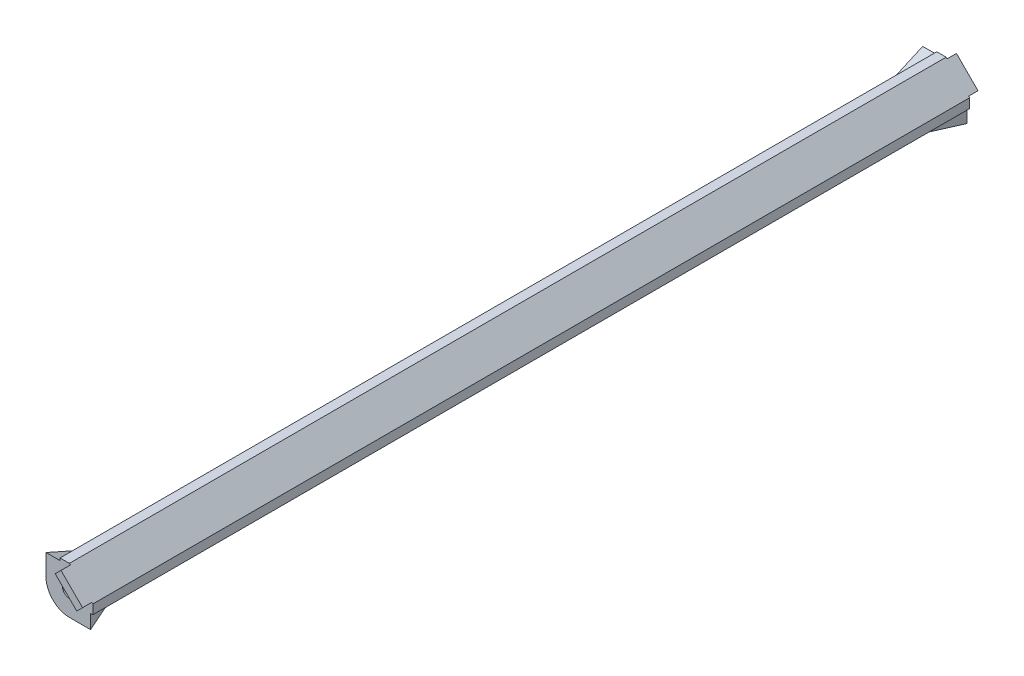
ISO-10303-21;
HEADER;
FILE_DESCRIPTION(('STEP AP214'),'2;1');
FILE_NAME('part.step','',(''),(''),'','','');
FILE_SCHEMA(('AUTOMOTIVE_DESIGN { 1 0 10303 214 1 1 1 1 }'));
ENDSEC;
DATA;
#1=APPLICATION_CONTEXT('core data for automotive mechanical design processes');
#2=APPLICATION_PROTOCOL_DEFINITION('international standard','automotive_design',2000,#1);
#3=PRODUCT_CONTEXT('',#1,'mechanical');
#4=PRODUCT('Part','Part','',(#3));
#5=PRODUCT_RELATED_PRODUCT_CATEGORY('part','',(#4));
#6=PRODUCT_DEFINITION_FORMATION('','',#4);
#7=PRODUCT_DEFINITION_CONTEXT('part definition',#1,'design');
#8=PRODUCT_DEFINITION('design','',#6,#7);
#9=PRODUCT_DEFINITION_SHAPE('','',#8);
#10=(LENGTH_UNIT() NAMED_UNIT(*) SI_UNIT(.MILLI.,.METRE.));
#11=(NAMED_UNIT(*) PLANE_ANGLE_UNIT() SI_UNIT($,.RADIAN.));
#12=(NAMED_UNIT(*) SI_UNIT($,.STERADIAN.) SOLID_ANGLE_UNIT());
#13=UNCERTAINTY_MEASURE_WITH_UNIT(LENGTH_MEASURE(1.E-05),#10,'distance_accuracy_value','');
#14=(GEOMETRIC_REPRESENTATION_CONTEXT(3) GLOBAL_UNCERTAINTY_ASSIGNED_CONTEXT((#13)) GLOBAL_UNIT_ASSIGNED_CONTEXT((#10,
#11,#12)) REPRESENTATION_CONTEXT('',''));
#15=CARTESIAN_POINT('',(0.,0.,0.));
#16=DIRECTION('',(0.,0.,1.));
#17=DIRECTION('',(1.,0.,0.));
#18=AXIS2_PLACEMENT_3D('',#15,#16,#17);
#19=CARTESIAN_POINT('',(10.,-5.,187.));
#20=DIRECTION('',(0.,1.,0.));
#21=DIRECTION('',(-1.,0.,0.));
#22=AXIS2_PLACEMENT_3D('',#19,#20,#21);
#23=PLANE('',#22);
#24=DIRECTION('',(-0.406138466053449,0.,0.913811548620256));
#25=VECTOR('',#24,1.);
#26=CARTESIAN_POINT('',(9.5,-5.,0.));
#27=LINE('',#26,#25);
#28=CARTESIAN_POINT('',(9.5,-5.,0.));
#29=VERTEX_POINT('',#28);
#30=CARTESIAN_POINT('',(5.49999999999998,-5.,9.));
#31=VERTEX_POINT('',#30);
#32=EDGE_CURVE('E250',#29,#31,#27,.T.);
#33=ORIENTED_EDGE('',*,*,#32,.T.);
#34=DIRECTION('',(0.,0.,1.));
#35=VECTOR('',#34,1.);
#36=CARTESIAN_POINT('',(5.5,-5.,178.));
#37=LINE('',#36,#35);
#38=CARTESIAN_POINT('',(5.5,-5.,178.));
#39=VERTEX_POINT('',#38);
#40=EDGE_CURVE('E265',#31,#39,#37,.T.);
#41=ORIENTED_EDGE('',*,*,#40,.T.);
#42=DIRECTION('',(0.406138466053447,0.,0.913811548620257));
#43=VECTOR('',#42,1.);
#44=CARTESIAN_POINT('',(5.5,-5.,178.));
#45=LINE('',#44,#43);
#46=CARTESIAN_POINT('',(9.5,-5.,187.));
#47=VERTEX_POINT('',#46);
#48=EDGE_CURVE('E245',#39,#47,#45,.T.);
#49=ORIENTED_EDGE('',*,*,#48,.T.);
#50=DIRECTION('',(1.,0.,0.));
#51=VECTOR('',#50,1.);
#52=CARTESIAN_POINT('',(10.,-5.,187.));
#53=LINE('',#52,#51);
#54=CARTESIAN_POINT('',(5.,-5.,187.));
#55=VERTEX_POINT('',#54);
#56=EDGE_CURVE('E321',#55,#47,#53,.T.);
#57=ORIENTED_EDGE('',*,*,#56,.F.);
#58=DIRECTION('',(0.,0.,-1.));
#59=VECTOR('',#58,1.);
#60=CARTESIAN_POINT('',(5.,-5.,187.));
#61=LINE('',#60,#59);
#62=CARTESIAN_POINT('',(5.,-5.,0.));
#63=VERTEX_POINT('',#62);
#64=EDGE_CURVE('E46',#55,#63,#61,.T.);
#65=ORIENTED_EDGE('',*,*,#64,.T.);
#66=DIRECTION('',(1.,0.,0.));
#67=VECTOR('',#66,1.);
#68=CARTESIAN_POINT('',(10.,-5.,0.));
#69=LINE('',#68,#67);
#70=EDGE_CURVE('E339',#63,#29,#69,.T.);
#71=ORIENTED_EDGE('',*,*,#70,.T.);
#72=EDGE_LOOP('',(#33,#41,#49,#57,#65,#71));
#73=FACE_BOUND('',#72,.T.);
#74=ADVANCED_FACE('F38',(#73),#23,.F.);
#75=CARTESIAN_POINT('',(5.,0.,187.));
#76=DIRECTION('',(0.,0.,-1.));
#77=DIRECTION('',(-1.,0.,0.));
#78=AXIS2_PLACEMENT_3D('',#75,#76,#77);
#79=PLANE('',#78);
#80=CARTESIAN_POINT('',(5.,0.,187.));
#81=DIRECTION('',(0.,0.,1.));
#82=DIRECTION('',(1.,0.,0.));
#83=AXIS2_PLACEMENT_3D('',#80,#81,#82);
#84=CIRCLE('',#83,1.5);
#85=CARTESIAN_POINT('',(6.5,0.,187.));
#86=VERTEX_POINT('',#85);
#87=EDGE_CURVE('E306',#86,#86,#84,.T.);
#88=ORIENTED_EDGE('',*,*,#87,.F.);
#89=EDGE_LOOP('',(#88));
#90=FACE_BOUND('',#89,.T.);
#91=DIRECTION('',(-0.707106781186548,0.707106781186547,0.));
#92=VECTOR('',#91,1.);
#93=CARTESIAN_POINT('',(5.,5.,187.));
#94=LINE('',#93,#92);
#95=CARTESIAN_POINT('',(10.,0.,187.));
#96=VERTEX_POINT('',#95);
#97=CARTESIAN_POINT('',(9.79809703885628,0.20190296114372,187.));
#98=VERTEX_POINT('',#97);
#99=EDGE_CURVE('E328',#96,#98,#94,.T.);
#100=ORIENTED_EDGE('',*,*,#99,.T.);
#101=DIRECTION('',(-0.707106781186547,-0.707106781186549,0.));
#102=VECTOR('',#101,1.);
#103=CARTESIAN_POINT('',(7.29809703885629,-2.29809703885628,187.));
#104=LINE('',#103,#102);
#105=CARTESIAN_POINT('',(8.56066017177982,-1.03553390593274,187.));
#106=VERTEX_POINT('',#105);
#107=EDGE_CURVE('E240',#98,#106,#104,.T.);
#108=ORIENTED_EDGE('',*,*,#107,.T.);
#109=DIRECTION('',(-0.707106781186548,0.707106781186547,0.));
#110=VECTOR('',#109,1.);
#111=CARTESIAN_POINT('',(6.26256313292354,1.26256313292354,187.));
#112=LINE('',#111,#110);
#113=CARTESIAN_POINT('',(3.96446609406726,3.56066017177982,187.));
#114=VERTEX_POINT('',#113);
#115=EDGE_CURVE('E243',#106,#114,#112,.T.);
#116=ORIENTED_EDGE('',*,*,#115,.T.);
#117=DIRECTION('',(0.707106781186548,0.707106781186548,0.));
#118=VECTOR('',#117,1.);
#119=CARTESIAN_POINT('',(2.70190296114372,2.29809703885628,187.));
#120=LINE('',#119,#118);
#121=CARTESIAN_POINT('',(5.20190296114372,4.79809703885628,187.));
#122=VERTEX_POINT('',#121);
#123=EDGE_CURVE('E189',#114,#122,#120,.T.);
#124=ORIENTED_EDGE('',*,*,#123,.T.);
#125=CARTESIAN_POINT('',(5.,5.,187.));
#126=VERTEX_POINT('',#125);
#127=EDGE_CURVE('E327',#122,#126,#94,.T.);
#128=ORIENTED_EDGE('',*,*,#127,.T.);
#129=DIRECTION('',(-1.,0.,0.));
#130=VECTOR('',#129,1.);
#131=CARTESIAN_POINT('',(0.,5.,187.));
#132=LINE('',#131,#130);
#133=CARTESIAN_POINT('',(3.,5.,187.));
#134=VERTEX_POINT('',#133);
#135=EDGE_CURVE('E331',#126,#134,#132,.T.);
#136=ORIENTED_EDGE('',*,*,#135,.T.);
#137=DIRECTION('',(0.,1.,0.));
#138=VECTOR('',#137,1.);
#139=CARTESIAN_POINT('',(3.,5.,187.));
#140=LINE('',#139,#138);
#141=CARTESIAN_POINT('',(3.,4.5,187.));
#142=VERTEX_POINT('',#141);
#143=EDGE_CURVE('E279',#142,#134,#140,.T.);
#144=ORIENTED_EDGE('',*,*,#143,.F.);
#145=DIRECTION('',(-1.,0.,0.));
#146=VECTOR('',#145,1.);
#147=CARTESIAN_POINT('',(3.,4.5,187.));
#148=LINE('',#147,#146);
#149=CARTESIAN_POINT('',(0.,4.5,187.));
#150=VERTEX_POINT('',#149);
#151=EDGE_CURVE('E303',#142,#150,#148,.T.);
#152=ORIENTED_EDGE('',*,*,#151,.T.);
#153=DIRECTION('',(0.,-1.,0.));
#154=VECTOR('',#153,1.);
#155=CARTESIAN_POINT('',(0.,0.,187.));
#156=LINE('',#155,#154);
#157=CARTESIAN_POINT('',(0.,0.,187.));
#158=VERTEX_POINT('',#157);
#159=EDGE_CURVE('E334',#150,#158,#156,.T.);
#160=ORIENTED_EDGE('',*,*,#159,.T.);
#161=CARTESIAN_POINT('',(5.,0.,187.));
#162=DIRECTION('',(0.,0.,1.));
#163=DIRECTION('',(-1.,0.,0.));
#164=AXIS2_PLACEMENT_3D('',#161,#162,#163);
#165=CIRCLE('',#164,5.);
#166=EDGE_CURVE('E318',#158,#55,#165,.T.);
#167=ORIENTED_EDGE('',*,*,#166,.T.);
#168=ORIENTED_EDGE('',*,*,#56,.T.);
#169=DIRECTION('',(0.,-1.,0.));
#170=VECTOR('',#169,1.);
#171=CARTESIAN_POINT('',(9.5,-2.,187.));
#172=LINE('',#171,#170);
#173=CARTESIAN_POINT('',(9.5,-2.,187.));
#174=VERTEX_POINT('',#173);
#175=EDGE_CURVE('E262',#174,#47,#172,.T.);
#176=ORIENTED_EDGE('',*,*,#175,.F.);
#177=DIRECTION('',(1.,0.,0.));
#178=VECTOR('',#177,1.);
#179=CARTESIAN_POINT('',(10.,-2.,187.));
#180=LINE('',#179,#178);
#181=CARTESIAN_POINT('',(10.,-2.,187.));
#182=VERTEX_POINT('',#181);
#183=EDGE_CURVE('E246',#174,#182,#180,.T.);
#184=ORIENTED_EDGE('',*,*,#183,.T.);
#185=DIRECTION('',(0.,1.,0.));
#186=VECTOR('',#185,1.);
#187=CARTESIAN_POINT('',(10.,0.,187.));
#188=LINE('',#187,#186);
#189=EDGE_CURVE('E325',#182,#96,#188,.T.);
#190=ORIENTED_EDGE('',*,*,#189,.T.);
#191=EDGE_LOOP('',(#100,#108,#116,#124,#128,#136,#144,#152,#160,#167,#168,#176,#184,#190));
#192=FACE_BOUND('',#191,.T.);
#193=ADVANCED_FACE('F387',(#90,#192),#79,.F.);
#194=CARTESIAN_POINT('',(5.,0.,0.));
#195=DIRECTION('',(0.,0.,-1.));
#196=DIRECTION('',(-1.,0.,0.));
#197=AXIS2_PLACEMENT_3D('',#194,#195,#196);
#198=PLANE('',#197);
#199=DIRECTION('',(-0.707106781186547,-0.707106781186549,0.));
#200=VECTOR('',#199,1.);
#201=CARTESIAN_POINT('',(7.29809703885629,-2.29809703885628,0.));
#202=LINE('',#201,#200);
#203=CARTESIAN_POINT('',(9.79809703885628,0.201902961143721,0.));
#204=VERTEX_POINT('',#203);
#205=CARTESIAN_POINT('',(8.56066017177982,-1.03553390593274,0.));
#206=VERTEX_POINT('',#205);
#207=EDGE_CURVE('E238',#204,#206,#202,.T.);
#208=ORIENTED_EDGE('',*,*,#207,.F.);
#209=DIRECTION('',(-0.707106781186548,0.707106781186547,0.));
#210=VECTOR('',#209,1.);
#211=CARTESIAN_POINT('',(5.,5.,0.));
#212=LINE('',#211,#210);
#213=CARTESIAN_POINT('',(10.,0.,0.));
#214=VERTEX_POINT('',#213);
#215=EDGE_CURVE('E345',#214,#204,#212,.T.);
#216=ORIENTED_EDGE('',*,*,#215,.F.);
#217=DIRECTION('',(0.,1.,0.));
#218=VECTOR('',#217,1.);
#219=CARTESIAN_POINT('',(10.,0.,0.));
#220=LINE('',#219,#218);
#221=CARTESIAN_POINT('',(10.,-2.,0.));
#222=VERTEX_POINT('',#221);
#223=EDGE_CURVE('E342',#222,#214,#220,.T.);
#224=ORIENTED_EDGE('',*,*,#223,.F.);
#225=DIRECTION('',(-1.,0.,0.));
#226=VECTOR('',#225,1.);
#227=CARTESIAN_POINT('',(10.,-2.,0.));
#228=LINE('',#227,#226);
#229=CARTESIAN_POINT('',(9.5,-2.,0.));
#230=VERTEX_POINT('',#229);
#231=EDGE_CURVE('E256',#222,#230,#228,.T.);
#232=ORIENTED_EDGE('',*,*,#231,.T.);
#233=DIRECTION('',(0.,-1.,0.));
#234=VECTOR('',#233,1.);
#235=CARTESIAN_POINT('',(9.5,-2.,0.));
#236=LINE('',#235,#234);
#237=EDGE_CURVE('E270',#230,#29,#236,.T.);
#238=ORIENTED_EDGE('',*,*,#237,.T.);
#239=ORIENTED_EDGE('',*,*,#70,.F.);
#240=CARTESIAN_POINT('',(5.,0.,0.));
#241=DIRECTION('',(0.,0.,1.));
#242=DIRECTION('',(-1.,0.,0.));
#243=AXIS2_PLACEMENT_3D('',#240,#241,#242);
#244=CIRCLE('',#243,5.);
#245=CARTESIAN_POINT('',(0.,0.,0.));
#246=VERTEX_POINT('',#245);
#247=EDGE_CURVE('E315',#246,#63,#244,.T.);
#248=ORIENTED_EDGE('',*,*,#247,.F.);
#249=DIRECTION('',(0.,-1.,0.));
#250=VECTOR('',#249,1.);
#251=CARTESIAN_POINT('',(0.,0.,0.));
#252=LINE('',#251,#250);
#253=CARTESIAN_POINT('',(0.,4.5,0.));
#254=VERTEX_POINT('',#253);
#255=EDGE_CURVE('E322',#254,#246,#252,.T.);
#256=ORIENTED_EDGE('',*,*,#255,.F.);
#257=DIRECTION('',(-1.,0.,0.));
#258=VECTOR('',#257,1.);
#259=CARTESIAN_POINT('',(3.,4.5,0.));
#260=LINE('',#259,#258);
#261=CARTESIAN_POINT('',(3.,4.5,0.));
#262=VERTEX_POINT('',#261);
#263=EDGE_CURVE('E296',#262,#254,#260,.T.);
#264=ORIENTED_EDGE('',*,*,#263,.F.);
#265=DIRECTION('',(0.,-1.,0.));
#266=VECTOR('',#265,1.);
#267=CARTESIAN_POINT('',(3.,5.,0.));
#268=LINE('',#267,#266);
#269=CARTESIAN_POINT('',(3.,5.,0.));
#270=VERTEX_POINT('',#269);
#271=EDGE_CURVE('E284',#270,#262,#268,.T.);
#272=ORIENTED_EDGE('',*,*,#271,.F.);
#273=DIRECTION('',(-1.,0.,0.));
#274=VECTOR('',#273,1.);
#275=CARTESIAN_POINT('',(0.,5.,0.));
#276=LINE('',#275,#274);
#277=CARTESIAN_POINT('',(5.,5.,0.));
#278=VERTEX_POINT('',#277);
#279=EDGE_CURVE('E348',#278,#270,#276,.T.);
#280=ORIENTED_EDGE('',*,*,#279,.F.);
#281=CARTESIAN_POINT('',(5.20190296114372,4.79809703885628,0.));
#282=VERTEX_POINT('',#281);
#283=EDGE_CURVE('E344',#282,#278,#212,.T.);
#284=ORIENTED_EDGE('',*,*,#283,.F.);
#285=DIRECTION('',(0.707106781186548,0.707106781186548,0.));
#286=VECTOR('',#285,1.);
#287=CARTESIAN_POINT('',(2.70190296114372,2.29809703885628,0.));
#288=LINE('',#287,#286);
#289=CARTESIAN_POINT('',(3.96446609406726,3.56066017177982,0.));
#290=VERTEX_POINT('',#289);
#291=EDGE_CURVE('E56',#290,#282,#288,.T.);
#292=ORIENTED_EDGE('',*,*,#291,.F.);
#293=DIRECTION('',(-0.707106781186548,0.707106781186547,0.));
#294=VECTOR('',#293,1.);
#295=CARTESIAN_POINT('',(6.26256313292354,1.26256313292354,0.));
#296=LINE('',#295,#294);
#297=EDGE_CURVE('E12',#206,#290,#296,.T.);
#298=ORIENTED_EDGE('',*,*,#297,.F.);
#299=EDGE_LOOP('',(#208,#216,#224,#232,#238,#239,#248,#256,#264,#272,#280,#284,#292,#298));
#300=FACE_BOUND('',#299,.T.);
#301=CARTESIAN_POINT('',(5.,0.,0.));
#302=DIRECTION('',(0.,0.,1.));
#303=DIRECTION('',(1.,0.,0.));
#304=AXIS2_PLACEMENT_3D('',#301,#302,#303);
#305=CIRCLE('',#304,1.5);
#306=CARTESIAN_POINT('',(6.5,0.,0.));
#307=VERTEX_POINT('',#306);
#308=EDGE_CURVE('E312',#307,#307,#305,.T.);
#309=ORIENTED_EDGE('',*,*,#308,.T.);
#310=EDGE_LOOP('',(#309));
#311=FACE_BOUND('',#310,.T.);
#312=ADVANCED_FACE('F367',(#300,#311),#198,.T.);
#313=CARTESIAN_POINT('',(5.,0.,187.));
#314=DIRECTION('',(0.,0.,-1.));
#315=DIRECTION('',(-1.,0.,0.));
#316=AXIS2_PLACEMENT_3D('',#313,#314,#315);
#317=CYLINDRICAL_SURFACE('',#316,5.);
#318=ORIENTED_EDGE('',*,*,#247,.T.);
#319=ORIENTED_EDGE('',*,*,#64,.F.);
#320=ORIENTED_EDGE('',*,*,#166,.F.);
#321=DIRECTION('',(0.,0.,-1.));
#322=VECTOR('',#321,1.);
#323=CARTESIAN_POINT('',(0.,0.,187.));
#324=LINE('',#323,#322);
#325=EDGE_CURVE('E336',#158,#246,#324,.T.);
#326=ORIENTED_EDGE('',*,*,#325,.T.);
#327=EDGE_LOOP('',(#318,#319,#320,#326));
#328=FACE_BOUND('',#327,.T.);
#329=ADVANCED_FACE('F40',(#328),#317,.T.);
#330=CARTESIAN_POINT('',(10.,0.,187.));
#331=DIRECTION('',(-1.,0.,0.));
#332=DIRECTION('',(0.,0.,1.));
#333=AXIS2_PLACEMENT_3D('',#330,#331,#332);
#334=PLANE('',#333);
#335=ORIENTED_EDGE('',*,*,#189,.F.);
#336=DIRECTION('',(0.,0.,-1.));
#337=VECTOR('',#336,1.);
#338=CARTESIAN_POINT('',(10.,-2.,0.));
#339=LINE('',#338,#337);
#340=EDGE_CURVE('E259',#182,#222,#339,.T.);
#341=ORIENTED_EDGE('',*,*,#340,.T.);
#342=ORIENTED_EDGE('',*,*,#223,.T.);
#343=DIRECTION('',(0.,0.,-1.));
#344=VECTOR('',#343,1.);
#345=CARTESIAN_POINT('',(10.,0.,187.));
#346=LINE('',#345,#344);
#347=EDGE_CURVE('E357',#96,#214,#346,.T.);
#348=ORIENTED_EDGE('',*,*,#347,.F.);
#349=EDGE_LOOP('',(#335,#341,#342,#348));
#350=FACE_BOUND('',#349,.T.);
#351=ADVANCED_FACE('F425',(#350),#334,.F.);
#352=CARTESIAN_POINT('',(5.,5.,187.));
#353=DIRECTION('',(-0.707106781186547,-0.707106781186548,0.));
#354=DIRECTION('',(0.707106781186548,-0.707106781186547,0.));
#355=AXIS2_PLACEMENT_3D('',#352,#353,#354);
#356=PLANE('',#355);
#357=ORIENTED_EDGE('',*,*,#127,.F.);
#358=DIRECTION('',(0.,0.,1.));
#359=VECTOR('',#358,1.);
#360=CARTESIAN_POINT('',(5.20190296114372,4.79809703885628,-12.25));
#361=LINE('',#360,#359);
#362=CARTESIAN_POINT('',(5.20190296114372,4.79809703885628,189.));
#363=VERTEX_POINT('',#362);
#364=EDGE_CURVE('E222',#122,#363,#361,.T.);
#365=ORIENTED_EDGE('',*,*,#364,.T.);
#366=DIRECTION('',(-0.707106781186547,0.707106781186548,0.));
#367=VECTOR('',#366,1.);
#368=CARTESIAN_POINT('',(5.20190296114372,4.79809703885628,189.));
#369=LINE('',#368,#367);
#370=CARTESIAN_POINT('',(9.79809703885628,0.20190296114372,189.));
#371=VERTEX_POINT('',#370);
#372=EDGE_CURVE('E208',#371,#363,#369,.T.);
#373=ORIENTED_EDGE('',*,*,#372,.F.);
#374=DIRECTION('',(0.,0.,1.));
#375=VECTOR('',#374,1.);
#376=CARTESIAN_POINT('',(9.79809703885628,0.20190296114372,-12.25));
#377=LINE('',#376,#375);
#378=EDGE_CURVE('E227',#98,#371,#377,.T.);
#379=ORIENTED_EDGE('',*,*,#378,.F.);
#380=ORIENTED_EDGE('',*,*,#99,.F.);
#381=ORIENTED_EDGE('',*,*,#347,.T.);
#382=ORIENTED_EDGE('',*,*,#215,.T.);
#383=CARTESIAN_POINT('',(9.79809703885628,0.201902961143719,-2.));
#384=VERTEX_POINT('',#383);
#385=EDGE_CURVE('E223',#384,#204,#377,.T.);
#386=ORIENTED_EDGE('',*,*,#385,.F.);
#387=DIRECTION('',(-0.707106781186547,0.707106781186548,0.));
#388=VECTOR('',#387,1.);
#389=CARTESIAN_POINT('',(5.20190296114372,4.79809703885628,-2.));
#390=LINE('',#389,#388);
#391=CARTESIAN_POINT('',(5.20190296114372,4.79809703885628,-2.));
#392=VERTEX_POINT('',#391);
#393=EDGE_CURVE('E219',#384,#392,#390,.T.);
#394=ORIENTED_EDGE('',*,*,#393,.T.);
#395=EDGE_CURVE('E218',#392,#282,#361,.T.);
#396=ORIENTED_EDGE('',*,*,#395,.T.);
#397=ORIENTED_EDGE('',*,*,#283,.T.);
#398=DIRECTION('',(0.,0.,-1.));
#399=VECTOR('',#398,1.);
#400=CARTESIAN_POINT('',(5.,5.,187.));
#401=LINE('',#400,#399);
#402=EDGE_CURVE('E354',#126,#278,#401,.T.);
#403=ORIENTED_EDGE('',*,*,#402,.F.);
#404=EDGE_LOOP('',(#357,#365,#373,#379,#380,#381,#382,#386,#394,#396,#397,#403));
#405=FACE_BOUND('',#404,.T.);
#406=ADVANCED_FACE('F409',(#405),#356,.F.);
#407=CARTESIAN_POINT('',(0.,5.,187.));
#408=DIRECTION('',(0.,-1.,0.));
#409=DIRECTION('',(0.,0.,-1.));
#410=AXIS2_PLACEMENT_3D('',#407,#408,#409);
#411=PLANE('',#410);
#412=ORIENTED_EDGE('',*,*,#279,.T.);
#413=DIRECTION('',(0.,0.,-1.));
#414=VECTOR('',#413,1.);
#415=CARTESIAN_POINT('',(3.,5.,0.));
#416=LINE('',#415,#414);
#417=EDGE_CURVE('E281',#134,#270,#416,.T.);
#418=ORIENTED_EDGE('',*,*,#417,.F.);
#419=ORIENTED_EDGE('',*,*,#135,.F.);
#420=ORIENTED_EDGE('',*,*,#402,.T.);
#421=EDGE_LOOP('',(#412,#418,#419,#420));
#422=FACE_BOUND('',#421,.T.);
#423=ADVANCED_FACE('F404',(#422),#411,.F.);
#424=CARTESIAN_POINT('',(0.,0.,187.));
#425=DIRECTION('',(1.,0.,0.));
#426=DIRECTION('',(0.,0.,-1.));
#427=AXIS2_PLACEMENT_3D('',#424,#425,#426);
#428=PLANE('',#427);
#429=ORIENTED_EDGE('',*,*,#159,.F.);
#430=DIRECTION('',(0.,0.406138466053447,0.913811548620257));
#431=VECTOR('',#430,1.);
#432=CARTESIAN_POINT('',(0.,0.5,178.));
#433=LINE('',#432,#431);
#434=CARTESIAN_POINT('',(0.,0.5,178.));
#435=VERTEX_POINT('',#434);
#436=EDGE_CURVE('E282',#435,#150,#433,.T.);
#437=ORIENTED_EDGE('',*,*,#436,.F.);
#438=DIRECTION('',(0.,0.,1.));
#439=VECTOR('',#438,1.);
#440=CARTESIAN_POINT('',(0.,0.5,178.));
#441=LINE('',#440,#439);
#442=CARTESIAN_POINT('',(0.,0.49999999999998,9.));
#443=VERTEX_POINT('',#442);
#444=EDGE_CURVE('E299',#443,#435,#441,.T.);
#445=ORIENTED_EDGE('',*,*,#444,.F.);
#446=DIRECTION('',(0.,-0.406138466053449,0.913811548620256));
#447=VECTOR('',#446,1.);
#448=CARTESIAN_POINT('',(0.,4.5,0.));
#449=LINE('',#448,#447);
#450=EDGE_CURVE('E273',#254,#443,#449,.T.);
#451=ORIENTED_EDGE('',*,*,#450,.F.);
#452=ORIENTED_EDGE('',*,*,#255,.T.);
#453=ORIENTED_EDGE('',*,*,#325,.F.);
#454=EDGE_LOOP('',(#429,#437,#445,#451,#452,#453));
#455=FACE_BOUND('',#454,.T.);
#456=ADVANCED_FACE('F393',(#455),#428,.F.);
#457=CARTESIAN_POINT('',(5.,0.,0.));
#458=DIRECTION('',(0.,0.,1.));
#459=DIRECTION('',(1.,0.,0.));
#460=AXIS2_PLACEMENT_3D('',#457,#458,#459);
#461=CYLINDRICAL_SURFACE('',#460,1.5);
#462=ORIENTED_EDGE('',*,*,#308,.F.);
#463=EDGE_LOOP('',(#462));
#464=FACE_BOUND('',#463,.T.);
#465=ORIENTED_EDGE('',*,*,#87,.T.);
#466=EDGE_LOOP('',(#465));
#467=FACE_BOUND('',#466,.T.);
#468=ADVANCED_FACE('F454',(#464,#467),#461,.F.);
#469=CARTESIAN_POINT('',(3.,0.5,178.));
#470=DIRECTION('',(0.,-0.913811548620257,0.406138466053447));
#471=DIRECTION('',(0.,-0.406138466053447,-0.913811548620257));
#472=AXIS2_PLACEMENT_3D('',#469,#470,#471);
#473=PLANE('',#472);
#474=ORIENTED_EDGE('',*,*,#436,.T.);
#475=ORIENTED_EDGE('',*,*,#151,.F.);
#476=DIRECTION('',(0.,0.406138466053447,0.913811548620257));
#477=VECTOR('',#476,1.);
#478=CARTESIAN_POINT('',(3.,0.5,178.));
#479=LINE('',#478,#477);
#480=CARTESIAN_POINT('',(3.,0.5,178.));
#481=VERTEX_POINT('',#480);
#482=EDGE_CURVE('E293',#481,#142,#479,.T.);
#483=ORIENTED_EDGE('',*,*,#482,.F.);
#484=DIRECTION('',(-1.,0.,0.));
#485=VECTOR('',#484,1.);
#486=CARTESIAN_POINT('',(3.,0.5,178.));
#487=LINE('',#486,#485);
#488=EDGE_CURVE('E307',#481,#435,#487,.T.);
#489=ORIENTED_EDGE('',*,*,#488,.T.);
#490=EDGE_LOOP('',(#474,#475,#483,#489));
#491=FACE_BOUND('',#490,.T.);
#492=ADVANCED_FACE('F459',(#491),#473,.F.);
#493=CARTESIAN_POINT('',(3.,0.5,178.));
#494=DIRECTION('',(0.,-1.,0.));
#495=DIRECTION('',(0.,0.,-1.));
#496=AXIS2_PLACEMENT_3D('',#493,#494,#495);
#497=PLANE('',#496);
#498=ORIENTED_EDGE('',*,*,#444,.T.);
#499=ORIENTED_EDGE('',*,*,#488,.F.);
#500=DIRECTION('',(0.,0.,1.));
#501=VECTOR('',#500,1.);
#502=CARTESIAN_POINT('',(3.,0.5,178.));
#503=LINE('',#502,#501);
#504=CARTESIAN_POINT('',(3.,0.49999999999998,9.));
#505=VERTEX_POINT('',#504);
#506=EDGE_CURVE('E290',#505,#481,#503,.T.);
#507=ORIENTED_EDGE('',*,*,#506,.F.);
#508=DIRECTION('',(-1.,0.,0.));
#509=VECTOR('',#508,1.);
#510=CARTESIAN_POINT('',(3.,0.49999999999998,9.));
#511=LINE('',#510,#509);
#512=EDGE_CURVE('E309',#505,#443,#511,.T.);
#513=ORIENTED_EDGE('',*,*,#512,.T.);
#514=EDGE_LOOP('',(#498,#499,#507,#513));
#515=FACE_BOUND('',#514,.T.);
#516=ADVANCED_FACE('F464',(#515),#497,.F.);
#517=CARTESIAN_POINT('',(3.,4.5,0.));
#518=DIRECTION('',(0.,-0.913811548620256,-0.406138466053449));
#519=DIRECTION('',(0.,0.406138466053449,-0.913811548620256));
#520=AXIS2_PLACEMENT_3D('',#517,#518,#519);
#521=PLANE('',#520);
#522=ORIENTED_EDGE('',*,*,#450,.T.);
#523=ORIENTED_EDGE('',*,*,#512,.F.);
#524=DIRECTION('',(0.,-0.406138466053449,0.913811548620256));
#525=VECTOR('',#524,1.);
#526=CARTESIAN_POINT('',(3.,4.5,0.));
#527=LINE('',#526,#525);
#528=EDGE_CURVE('E287',#262,#505,#527,.T.);
#529=ORIENTED_EDGE('',*,*,#528,.F.);
#530=ORIENTED_EDGE('',*,*,#263,.T.);
#531=EDGE_LOOP('',(#522,#523,#529,#530));
#532=FACE_BOUND('',#531,.T.);
#533=ADVANCED_FACE('F397',(#532),#521,.F.);
#534=CARTESIAN_POINT('',(3.,0.,0.));
#535=DIRECTION('',(1.,0.,0.));
#536=DIRECTION('',(0.,0.,-1.));
#537=AXIS2_PLACEMENT_3D('',#534,#535,#536);
#538=PLANE('',#537);
#539=ORIENTED_EDGE('',*,*,#143,.T.);
#540=ORIENTED_EDGE('',*,*,#417,.T.);
#541=ORIENTED_EDGE('',*,*,#271,.T.);
#542=ORIENTED_EDGE('',*,*,#528,.T.);
#543=ORIENTED_EDGE('',*,*,#506,.T.);
#544=ORIENTED_EDGE('',*,*,#482,.T.);
#545=EDGE_LOOP('',(#539,#540,#541,#542,#543,#544));
#546=FACE_BOUND('',#545,.T.);
#547=ADVANCED_FACE('F463',(#546),#538,.F.);
#548=CARTESIAN_POINT('',(9.5,-2.,0.));
#549=DIRECTION('',(0.913811548620256,0.,0.406138466053449));
#550=DIRECTION('',(0.406138466053449,0.,-0.913811548620256));
#551=AXIS2_PLACEMENT_3D('',#548,#549,#550);
#552=PLANE('',#551);
#553=ORIENTED_EDGE('',*,*,#32,.F.);
#554=ORIENTED_EDGE('',*,*,#237,.F.);
#555=DIRECTION('',(-0.406138466053449,0.,0.913811548620256));
#556=VECTOR('',#555,1.);
#557=CARTESIAN_POINT('',(9.5,-2.,0.));
#558=LINE('',#557,#556);
#559=CARTESIAN_POINT('',(5.49999999999998,-2.,9.));
#560=VERTEX_POINT('',#559);
#561=EDGE_CURVE('E254',#230,#560,#558,.T.);
#562=ORIENTED_EDGE('',*,*,#561,.T.);
#563=DIRECTION('',(0.,-1.,0.));
#564=VECTOR('',#563,1.);
#565=CARTESIAN_POINT('',(5.49999999999998,-2.,9.));
#566=LINE('',#565,#564);
#567=EDGE_CURVE('E274',#560,#31,#566,.T.);
#568=ORIENTED_EDGE('',*,*,#567,.T.);
#569=EDGE_LOOP('',(#553,#554,#562,#568));
#570=FACE_BOUND('',#569,.T.);
#571=ADVANCED_FACE('F373',(#570),#552,.T.);
#572=CARTESIAN_POINT('',(5.5,-2.,178.));
#573=DIRECTION('',(1.,0.,0.));
#574=DIRECTION('',(0.,1.,0.));
#575=AXIS2_PLACEMENT_3D('',#572,#573,#574);
#576=PLANE('',#575);
#577=ORIENTED_EDGE('',*,*,#40,.F.);
#578=ORIENTED_EDGE('',*,*,#567,.F.);
#579=DIRECTION('',(0.,0.,1.));
#580=VECTOR('',#579,1.);
#581=CARTESIAN_POINT('',(5.5,-2.,178.));
#582=LINE('',#581,#580);
#583=CARTESIAN_POINT('',(5.5,-2.,178.));
#584=VERTEX_POINT('',#583);
#585=EDGE_CURVE('E252',#560,#584,#582,.T.);
#586=ORIENTED_EDGE('',*,*,#585,.T.);
#587=DIRECTION('',(0.,-1.,0.));
#588=VECTOR('',#587,1.);
#589=CARTESIAN_POINT('',(5.5,-2.,178.));
#590=LINE('',#589,#588);
#591=EDGE_CURVE('E276',#584,#39,#590,.T.);
#592=ORIENTED_EDGE('',*,*,#591,.T.);
#593=EDGE_LOOP('',(#577,#578,#586,#592));
#594=FACE_BOUND('',#593,.T.);
#595=ADVANCED_FACE('F378',(#594),#576,.T.);
#596=CARTESIAN_POINT('',(5.5,-2.,178.));
#597=DIRECTION('',(0.913811548620257,0.,-0.406138466053447));
#598=DIRECTION('',(-0.406138466053447,0.,-0.913811548620257));
#599=AXIS2_PLACEMENT_3D('',#596,#597,#598);
#600=PLANE('',#599);
#601=ORIENTED_EDGE('',*,*,#48,.F.);
#602=ORIENTED_EDGE('',*,*,#591,.F.);
#603=DIRECTION('',(0.406138466053447,0.,0.913811548620257));
#604=VECTOR('',#603,1.);
#605=CARTESIAN_POINT('',(5.5,-2.,178.));
#606=LINE('',#605,#604);
#607=EDGE_CURVE('E249',#584,#174,#606,.T.);
#608=ORIENTED_EDGE('',*,*,#607,.T.);
#609=ORIENTED_EDGE('',*,*,#175,.T.);
#610=EDGE_LOOP('',(#601,#602,#608,#609));
#611=FACE_BOUND('',#610,.T.);
#612=ADVANCED_FACE('F383',(#611),#600,.T.);
#613=CARTESIAN_POINT('',(5.,-2.,0.));
#614=DIRECTION('',(0.,1.,0.));
#615=DIRECTION('',(0.,0.,-1.));
#616=AXIS2_PLACEMENT_3D('',#613,#614,#615);
#617=PLANE('',#616);
#618=ORIENTED_EDGE('',*,*,#183,.F.);
#619=ORIENTED_EDGE('',*,*,#607,.F.);
#620=ORIENTED_EDGE('',*,*,#585,.F.);
#621=ORIENTED_EDGE('',*,*,#561,.F.);
#622=ORIENTED_EDGE('',*,*,#231,.F.);
#623=ORIENTED_EDGE('',*,*,#340,.F.);
#624=EDGE_LOOP('',(#618,#619,#620,#621,#622,#623));
#625=FACE_BOUND('',#624,.T.);
#626=ADVANCED_FACE('F427',(#625),#617,.F.);
#627=CARTESIAN_POINT('',(5.,0.,-2.));
#628=DIRECTION('',(0.,0.,-1.));
#629=DIRECTION('',(-1.,0.,0.));
#630=AXIS2_PLACEMENT_3D('',#627,#628,#629);
#631=PLANE('',#630);
#632=DIRECTION('',(-0.707106781186548,-0.707106781186548,0.));
#633=VECTOR('',#632,1.);
#634=CARTESIAN_POINT('',(3.96446609406726,3.56066017177982,-2.));
#635=LINE('',#634,#633);
#636=CARTESIAN_POINT('',(3.96446609406726,3.56066017177982,-2.));
#637=VERTEX_POINT('',#636);
#638=EDGE_CURVE('E193',#392,#637,#635,.T.);
#639=ORIENTED_EDGE('',*,*,#638,.F.);
#640=ORIENTED_EDGE('',*,*,#393,.F.);
#641=DIRECTION('',(0.707106781186547,0.707106781186549,0.));
#642=VECTOR('',#641,1.);
#643=CARTESIAN_POINT('',(9.79809703885628,0.20190296114372,-2.));
#644=LINE('',#643,#642);
#645=CARTESIAN_POINT('',(8.56066017177982,-1.03553390593274,-2.));
#646=VERTEX_POINT('',#645);
#647=EDGE_CURVE('E224',#646,#384,#644,.T.);
#648=ORIENTED_EDGE('',*,*,#647,.F.);
#649=DIRECTION('',(0.707106781186548,-0.707106781186547,0.));
#650=VECTOR('',#649,1.);
#651=CARTESIAN_POINT('',(8.56066017177982,-1.03553390593274,-2.));
#652=LINE('',#651,#650);
#653=EDGE_CURVE('E213',#637,#646,#652,.T.);
#654=ORIENTED_EDGE('',*,*,#653,.F.);
#655=EDGE_LOOP('',(#639,#640,#648,#654));
#656=FACE_BOUND('',#655,.T.);
#657=ADVANCED_FACE('F429',(#656),#631,.T.);
#658=CARTESIAN_POINT('',(3.96446609406726,3.56066017177982,-12.25));
#659=DIRECTION('',(-0.707106781186547,0.707106781186547,0.));
#660=DIRECTION('',(-0.707106781186548,-0.707106781186548,0.));
#661=AXIS2_PLACEMENT_3D('',#658,#659,#660);
#662=PLANE('',#661);
#663=DIRECTION('',(0.,0.,1.));
#664=VECTOR('',#663,1.);
#665=CARTESIAN_POINT('',(3.96446609406726,3.56066017177982,-12.25));
#666=LINE('',#665,#664);
#667=EDGE_CURVE('E192',#637,#290,#666,.T.);
#668=ORIENTED_EDGE('',*,*,#667,.T.);
#669=ORIENTED_EDGE('',*,*,#291,.T.);
#670=ORIENTED_EDGE('',*,*,#395,.F.);
#671=ORIENTED_EDGE('',*,*,#638,.T.);
#672=EDGE_LOOP('',(#668,#669,#670,#671));
#673=FACE_BOUND('',#672,.T.);
#674=ADVANCED_FACE('F412',(#673),#662,.T.);
#675=CARTESIAN_POINT('',(9.79809703885628,0.20190296114372,-12.25));
#676=DIRECTION('',(0.707106781186548,-0.707106781186546,0.));
#677=DIRECTION('',(0.707106781186547,0.707106781186549,0.));
#678=AXIS2_PLACEMENT_3D('',#675,#676,#677);
#679=PLANE('',#678);
#680=ORIENTED_EDGE('',*,*,#385,.T.);
#681=ORIENTED_EDGE('',*,*,#207,.T.);
#682=DIRECTION('',(0.,0.,1.));
#683=VECTOR('',#682,1.);
#684=CARTESIAN_POINT('',(8.56066017177982,-1.03553390593274,-12.25));
#685=LINE('',#684,#683);
#686=EDGE_CURVE('E228',#646,#206,#685,.T.);
#687=ORIENTED_EDGE('',*,*,#686,.F.);
#688=ORIENTED_EDGE('',*,*,#647,.T.);
#689=EDGE_LOOP('',(#680,#681,#687,#688));
#690=FACE_BOUND('',#689,.T.);
#691=ADVANCED_FACE('F418',(#690),#679,.T.);
#692=CARTESIAN_POINT('',(8.56066017177982,-1.03553390593274,-12.25));
#693=DIRECTION('',(-0.707106781186547,-0.707106781186548,0.));
#694=DIRECTION('',(0.707106781186548,-0.707106781186547,0.));
#695=AXIS2_PLACEMENT_3D('',#692,#693,#694);
#696=PLANE('',#695);
#697=ORIENTED_EDGE('',*,*,#686,.T.);
#698=ORIENTED_EDGE('',*,*,#297,.T.);
#699=ORIENTED_EDGE('',*,*,#667,.F.);
#700=ORIENTED_EDGE('',*,*,#653,.T.);
#701=EDGE_LOOP('',(#697,#698,#699,#700));
#702=FACE_BOUND('',#701,.T.);
#703=ADVANCED_FACE('F415',(#702),#696,.T.);
#704=ORIENTED_EDGE('',*,*,#115,.F.);
#705=CARTESIAN_POINT('',(8.56066017177982,-1.03553390593274,189.));
#706=VERTEX_POINT('',#705);
#707=EDGE_CURVE('E199',#106,#706,#685,.T.);
#708=ORIENTED_EDGE('',*,*,#707,.T.);
#709=DIRECTION('',(0.707106781186548,-0.707106781186547,0.));
#710=VECTOR('',#709,1.);
#711=CARTESIAN_POINT('',(8.56066017177982,-1.03553390593274,189.));
#712=LINE('',#711,#710);
#713=CARTESIAN_POINT('',(3.96446609406726,3.56066017177982,189.));
#714=VERTEX_POINT('',#713);
#715=EDGE_CURVE('E196',#714,#706,#712,.T.);
#716=ORIENTED_EDGE('',*,*,#715,.F.);
#717=EDGE_CURVE('E183',#114,#714,#666,.T.);
#718=ORIENTED_EDGE('',*,*,#717,.F.);
#719=EDGE_LOOP('',(#704,#708,#716,#718));
#720=FACE_BOUND('',#719,.T.);
#721=ADVANCED_FACE('F197',(#720),#696,.T.);
#722=ORIENTED_EDGE('',*,*,#107,.F.);
#723=ORIENTED_EDGE('',*,*,#378,.T.);
#724=DIRECTION('',(0.707106781186546,0.707106781186548,0.));
#725=VECTOR('',#724,1.);
#726=CARTESIAN_POINT('',(9.79809703885628,0.20190296114372,189.));
#727=LINE('',#726,#725);
#728=EDGE_CURVE('E203',#706,#371,#727,.T.);
#729=ORIENTED_EDGE('',*,*,#728,.F.);
#730=ORIENTED_EDGE('',*,*,#707,.F.);
#731=EDGE_LOOP('',(#722,#723,#729,#730));
#732=FACE_BOUND('',#731,.T.);
#733=ADVANCED_FACE('F542',(#732),#679,.T.);
#734=ORIENTED_EDGE('',*,*,#123,.F.);
#735=ORIENTED_EDGE('',*,*,#717,.T.);
#736=DIRECTION('',(-0.707106781186548,-0.707106781186548,0.));
#737=VECTOR('',#736,1.);
#738=CARTESIAN_POINT('',(3.96446609406726,3.56066017177982,189.));
#739=LINE('',#738,#737);
#740=EDGE_CURVE('E187',#363,#714,#739,.T.);
#741=ORIENTED_EDGE('',*,*,#740,.F.);
#742=ORIENTED_EDGE('',*,*,#364,.F.);
#743=EDGE_LOOP('',(#734,#735,#741,#742));
#744=FACE_BOUND('',#743,.T.);
#745=ADVANCED_FACE('F185',(#744),#662,.T.);
#746=CARTESIAN_POINT('',(0.,0.,189.));
#747=DIRECTION('',(0.,0.,-1.));
#748=DIRECTION('',(-1.,0.,0.));
#749=AXIS2_PLACEMENT_3D('',#746,#747,#748);
#750=PLANE('',#749);
#751=ORIENTED_EDGE('',*,*,#740,.T.);
#752=ORIENTED_EDGE('',*,*,#715,.T.);
#753=ORIENTED_EDGE('',*,*,#728,.T.);
#754=ORIENTED_EDGE('',*,*,#372,.T.);
#755=EDGE_LOOP('',(#751,#752,#753,#754));
#756=FACE_BOUND('',#755,.T.);
#757=ADVANCED_FACE('F206',(#756),#750,.F.);
#758=CLOSED_SHELL('',(#74,#193,#312,#329,#351,#406,#423,#456,#468,#492,#516,#533,#547,#571,#595,
#612,#626,#657,#674,#691,#703,#721,#733,#745,#757));
#759=MANIFOLD_SOLID_BREP('B2',#758);
#760=ADVANCED_BREP_SHAPE_REPRESENTATION('',(#18,#759),#14);
#761=SHAPE_DEFINITION_REPRESENTATION(#9,#760);
ENDSEC;
END-ISO-10303-21;
